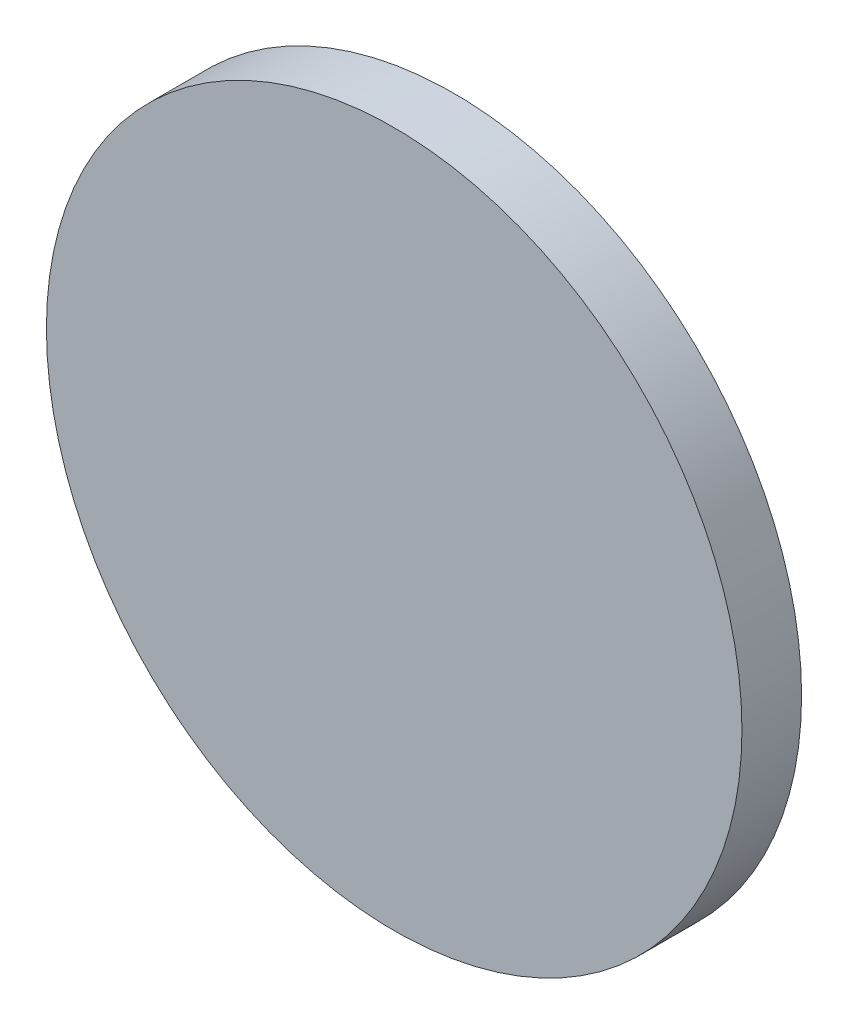
ISO-10303-21;
HEADER;
FILE_DESCRIPTION(('STEP AP214'),'2;1');
FILE_NAME('part.step','',(''),(''),'','','');
FILE_SCHEMA(('AUTOMOTIVE_DESIGN { 1 0 10303 214 1 1 1 1 }'));
ENDSEC;
DATA;
#1=APPLICATION_CONTEXT('core data for automotive mechanical design processes');
#2=APPLICATION_PROTOCOL_DEFINITION('international standard','automotive_design',2000,#1);
#3=PRODUCT_CONTEXT('',#1,'mechanical');
#4=PRODUCT('Part','Part','',(#3));
#5=PRODUCT_RELATED_PRODUCT_CATEGORY('part','',(#4));
#6=PRODUCT_DEFINITION_FORMATION('','',#4);
#7=PRODUCT_DEFINITION_CONTEXT('part definition',#1,'design');
#8=PRODUCT_DEFINITION('design','',#6,#7);
#9=PRODUCT_DEFINITION_SHAPE('','',#8);
#10=(LENGTH_UNIT() NAMED_UNIT(*) SI_UNIT(.MILLI.,.METRE.));
#11=(NAMED_UNIT(*) PLANE_ANGLE_UNIT() SI_UNIT($,.RADIAN.));
#12=(NAMED_UNIT(*) SI_UNIT($,.STERADIAN.) SOLID_ANGLE_UNIT());
#13=UNCERTAINTY_MEASURE_WITH_UNIT(LENGTH_MEASURE(1.E-05),#10,'distance_accuracy_value','');
#14=(GEOMETRIC_REPRESENTATION_CONTEXT(3) GLOBAL_UNCERTAINTY_ASSIGNED_CONTEXT((#13)) GLOBAL_UNIT_ASSIGNED_CONTEXT((#10,
#11,#12)) REPRESENTATION_CONTEXT('',''));
#15=CARTESIAN_POINT('',(0.,0.,0.));
#16=DIRECTION('',(0.,0.,1.));
#17=DIRECTION('',(1.,0.,0.));
#18=AXIS2_PLACEMENT_3D('',#15,#16,#17);
#19=CARTESIAN_POINT('',(3.0353,9.359900006176,0.76487));
#20=DIRECTION('',(0.,0.,-1.));
#21=DIRECTION('',(-1.,0.,0.));
#22=AXIS2_PLACEMENT_3D('',#19,#20,#21);
#23=PLANE('',#22);
#24=CARTESIAN_POINT('',(3.0353,9.359900006176,0.76487));
#25=DIRECTION('',(0.,0.,1.));
#26=DIRECTION('',(1.,0.,0.));
#27=AXIS2_PLACEMENT_3D('',#24,#25,#26);
#28=CIRCLE('',#27,0.200024667);
#29=CARTESIAN_POINT('',(3.235324667,9.359900006176,0.76487));
#30=VERTEX_POINT('',#29);
#31=EDGE_CURVE('E18',#30,#30,#28,.T.);
#32=ORIENTED_EDGE('',*,*,#31,.F.);
#33=EDGE_LOOP('',(#32));
#34=FACE_BOUND('',#33,.T.);
#35=ADVANCED_FACE('F15',(#34),#23,.T.);
#36=CARTESIAN_POINT('',(3.0353,9.359900006176,0.76487));
#37=DIRECTION('',(0.,0.,1.));
#38=DIRECTION('',(1.,0.,0.));
#39=AXIS2_PLACEMENT_3D('',#36,#37,#38);
#40=CYLINDRICAL_SURFACE('',#39,0.200024667);
#41=CARTESIAN_POINT('',(3.0353,9.359900006176,0.79916));
#42=DIRECTION('',(0.,0.,1.));
#43=DIRECTION('',(1.,0.,0.));
#44=AXIS2_PLACEMENT_3D('',#41,#42,#43);
#45=CIRCLE('',#44,0.200024667);
#46=CARTESIAN_POINT('',(3.235324667,9.359900006176,0.79916));
#47=VERTEX_POINT('',#46);
#48=EDGE_CURVE('E10',#47,#47,#45,.T.);
#49=ORIENTED_EDGE('',*,*,#48,.F.);
#50=EDGE_LOOP('',(#49));
#51=FACE_BOUND('',#50,.T.);
#52=ORIENTED_EDGE('',*,*,#31,.T.);
#53=EDGE_LOOP('',(#52));
#54=FACE_BOUND('',#53,.T.);
#55=ADVANCED_FACE('F27',(#51,#54),#40,.T.);
#56=CARTESIAN_POINT('',(3.0353,9.359900006176,0.79916));
#57=DIRECTION('',(0.,0.,1.));
#58=DIRECTION('',(1.,0.,0.));
#59=AXIS2_PLACEMENT_3D('',#56,#57,#58);
#60=PLANE('',#59);
#61=ORIENTED_EDGE('',*,*,#48,.T.);
#62=EDGE_LOOP('',(#61));
#63=FACE_BOUND('',#62,.T.);
#64=ADVANCED_FACE('F34',(#63),#60,.T.);
#65=CLOSED_SHELL('',(#35,#55,#64));
#66=MANIFOLD_SOLID_BREP('B1',#65);
#67=ADVANCED_BREP_SHAPE_REPRESENTATION('',(#18,#66),#14);
#68=SHAPE_DEFINITION_REPRESENTATION(#9,#67);
ENDSEC;
END-ISO-10303-21;
